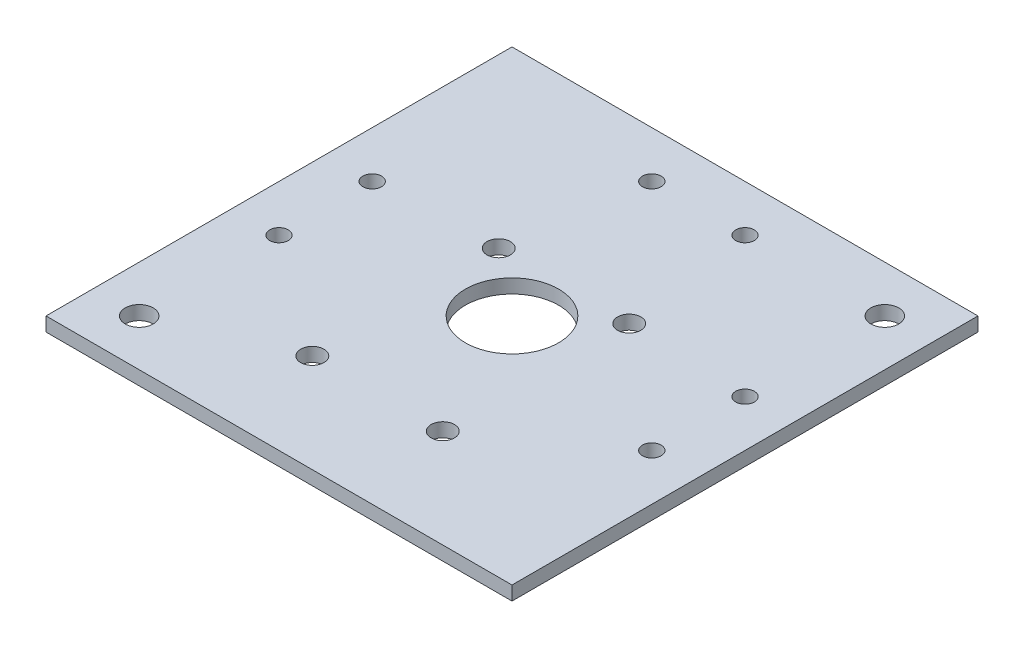
ISO-10303-21;
HEADER;
FILE_DESCRIPTION(('STEP AP214'),'2;1');
FILE_NAME('part.step','',(''),(''),'','','');
FILE_SCHEMA(('AUTOMOTIVE_DESIGN { 1 0 10303 214 1 1 1 1 }'));
ENDSEC;
DATA;
#1=APPLICATION_CONTEXT('core data for automotive mechanical design processes');
#2=APPLICATION_PROTOCOL_DEFINITION('international standard','automotive_design',2000,#1);
#3=PRODUCT_CONTEXT('',#1,'mechanical');
#4=PRODUCT('Part','Part','',(#3));
#5=PRODUCT_RELATED_PRODUCT_CATEGORY('part','',(#4));
#6=PRODUCT_DEFINITION_FORMATION('','',#4);
#7=PRODUCT_DEFINITION_CONTEXT('part definition',#1,'design');
#8=PRODUCT_DEFINITION('design','',#6,#7);
#9=PRODUCT_DEFINITION_SHAPE('','',#8);
#10=(LENGTH_UNIT() NAMED_UNIT(*) SI_UNIT(.MILLI.,.METRE.));
#11=(NAMED_UNIT(*) PLANE_ANGLE_UNIT() SI_UNIT($,.RADIAN.));
#12=(NAMED_UNIT(*) SI_UNIT($,.STERADIAN.) SOLID_ANGLE_UNIT());
#13=UNCERTAINTY_MEASURE_WITH_UNIT(LENGTH_MEASURE(1.E-05),#10,'distance_accuracy_value','');
#14=(GEOMETRIC_REPRESENTATION_CONTEXT(3) GLOBAL_UNCERTAINTY_ASSIGNED_CONTEXT((#13)) GLOBAL_UNIT_ASSIGNED_CONTEXT((#10,
#11,#12)) REPRESENTATION_CONTEXT('',''));
#15=CARTESIAN_POINT('',(0.,0.,0.));
#16=DIRECTION('',(0.,0.,1.));
#17=DIRECTION('',(1.,0.,0.));
#18=AXIS2_PLACEMENT_3D('',#15,#16,#17);
#19=CARTESIAN_POINT('',(-30.,58.,-55.001));
#20=DIRECTION('',(0.,1.,0.));
#21=DIRECTION('',(-1.,0.,0.));
#22=AXIS2_PLACEMENT_3D('',#19,#20,#21);
#23=PLANE('',#22);
#24=CARTESIAN_POINT('',(0.,58.,0.));
#25=DIRECTION('',(0.,1.,0.));
#26=DIRECTION('',(-1.,0.,0.));
#27=AXIS2_PLACEMENT_3D('',#24,#25,#26);
#28=CIRCLE('',#27,10.);
#29=CARTESIAN_POINT('',(-10.,58.,0.));
#30=VERTEX_POINT('',#29);
#31=EDGE_CURVE('E188',#30,#30,#28,.F.);
#32=ORIENTED_EDGE('',*,*,#31,.F.);
#33=EDGE_LOOP('',(#32));
#34=FACE_BOUND('',#33,.T.);
#35=CARTESIAN_POINT('',(-40.,58.,40.));
#36=DIRECTION('',(0.,1.,0.));
#37=DIRECTION('',(-1.,0.,0.));
#38=AXIS2_PLACEMENT_3D('',#35,#36,#37);
#39=CIRCLE('',#38,3.);
#40=CARTESIAN_POINT('',(-43.,58.,40.));
#41=VERTEX_POINT('',#40);
#42=EDGE_CURVE('E179',#41,#41,#39,.T.);
#43=ORIENTED_EDGE('',*,*,#42,.T.);
#44=EDGE_LOOP('',(#43));
#45=FACE_BOUND('',#44,.T.);
#46=CARTESIAN_POINT('',(40.,58.,-40.));
#47=DIRECTION('',(0.,1.,0.));
#48=DIRECTION('',(-1.,0.,0.));
#49=AXIS2_PLACEMENT_3D('',#46,#47,#48);
#50=CIRCLE('',#49,3.);
#51=CARTESIAN_POINT('',(37.,58.,-40.));
#52=VERTEX_POINT('',#51);
#53=EDGE_CURVE('E182',#52,#52,#50,.T.);
#54=ORIENTED_EDGE('',*,*,#53,.T.);
#55=EDGE_LOOP('',(#54));
#56=FACE_BOUND('',#55,.T.);
#57=CARTESIAN_POINT('',(-14.,58.,-11.15));
#58=DIRECTION('',(0.,1.,0.));
#59=DIRECTION('',(-1.,0.,0.));
#60=AXIS2_PLACEMENT_3D('',#57,#58,#59);
#61=CIRCLE('',#60,2.5);
#62=CARTESIAN_POINT('',(-16.5,58.,-11.15));
#63=VERTEX_POINT('',#62);
#64=EDGE_CURVE('E175',#63,#63,#61,.F.);
#65=ORIENTED_EDGE('',*,*,#64,.F.);
#66=EDGE_LOOP('',(#65));
#67=FACE_BOUND('',#66,.T.);
#68=CARTESIAN_POINT('',(-14.,58.,28.85));
#69=DIRECTION('',(0.,1.,0.));
#70=DIRECTION('',(-1.,0.,0.));
#71=AXIS2_PLACEMENT_3D('',#68,#69,#70);
#72=CIRCLE('',#71,2.5);
#73=CARTESIAN_POINT('',(-16.5,58.,28.85));
#74=VERTEX_POINT('',#73);
#75=EDGE_CURVE('E158',#74,#74,#72,.F.);
#76=ORIENTED_EDGE('',*,*,#75,.F.);
#77=EDGE_LOOP('',(#76));
#78=FACE_BOUND('',#77,.T.);
#79=CARTESIAN_POINT('',(14.,58.,28.85));
#80=DIRECTION('',(0.,1.,0.));
#81=DIRECTION('',(-1.,0.,0.));
#82=AXIS2_PLACEMENT_3D('',#79,#80,#81);
#83=CIRCLE('',#82,2.5);
#84=CARTESIAN_POINT('',(11.5,58.,28.85));
#85=VERTEX_POINT('',#84);
#86=EDGE_CURVE('E159',#85,#85,#83,.F.);
#87=ORIENTED_EDGE('',*,*,#86,.F.);
#88=EDGE_LOOP('',(#87));
#89=FACE_BOUND('',#88,.T.);
#90=CARTESIAN_POINT('',(14.,58.,-11.15));
#91=DIRECTION('',(0.,1.,0.));
#92=DIRECTION('',(-1.,0.,0.));
#93=AXIS2_PLACEMENT_3D('',#90,#91,#92);
#94=CIRCLE('',#93,2.5);
#95=CARTESIAN_POINT('',(11.5,58.,-11.15));
#96=VERTEX_POINT('',#95);
#97=EDGE_CURVE('E166',#96,#96,#94,.F.);
#98=ORIENTED_EDGE('',*,*,#97,.F.);
#99=EDGE_LOOP('',(#98));
#100=FACE_BOUND('',#99,.T.);
#101=CARTESIAN_POINT('',(40.,58.,-10.));
#102=DIRECTION('',(0.,1.,0.));
#103=DIRECTION('',(-1.,0.,0.));
#104=AXIS2_PLACEMENT_3D('',#101,#102,#103);
#105=CIRCLE('',#104,2.);
#106=CARTESIAN_POINT('',(38.,58.,-10.));
#107=VERTEX_POINT('',#106);
#108=EDGE_CURVE('E151',#107,#107,#105,.F.);
#109=ORIENTED_EDGE('',*,*,#108,.F.);
#110=EDGE_LOOP('',(#109));
#111=FACE_BOUND('',#110,.T.);
#112=CARTESIAN_POINT('',(-10.,58.,-40.));
#113=DIRECTION('',(0.,1.,0.));
#114=DIRECTION('',(-1.,0.,0.));
#115=AXIS2_PLACEMENT_3D('',#112,#113,#114);
#116=CIRCLE('',#115,2.);
#117=CARTESIAN_POINT('',(-12.,58.,-40.));
#118=VERTEX_POINT('',#117);
#119=EDGE_CURVE('E121',#118,#118,#116,.F.);
#120=ORIENTED_EDGE('',*,*,#119,.F.);
#121=EDGE_LOOP('',(#120));
#122=FACE_BOUND('',#121,.T.);
#123=CARTESIAN_POINT('',(9.99999999999999,58.,-40.));
#124=DIRECTION('',(0.,1.,0.));
#125=DIRECTION('',(-1.,0.,0.));
#126=AXIS2_PLACEMENT_3D('',#123,#124,#125);
#127=CIRCLE('',#126,2.);
#128=CARTESIAN_POINT('',(7.99999999999999,58.,-40.));
#129=VERTEX_POINT('',#128);
#130=EDGE_CURVE('E142',#129,#129,#127,.F.);
#131=ORIENTED_EDGE('',*,*,#130,.F.);
#132=EDGE_LOOP('',(#131));
#133=FACE_BOUND('',#132,.T.);
#134=CARTESIAN_POINT('',(-40.,58.,-10.));
#135=DIRECTION('',(0.,1.,0.));
#136=DIRECTION('',(-1.,0.,0.));
#137=AXIS2_PLACEMENT_3D('',#134,#135,#136);
#138=CIRCLE('',#137,2.);
#139=CARTESIAN_POINT('',(-42.,58.,-10.));
#140=VERTEX_POINT('',#139);
#141=EDGE_CURVE('E136',#140,#140,#138,.F.);
#142=ORIENTED_EDGE('',*,*,#141,.F.);
#143=EDGE_LOOP('',(#142));
#144=FACE_BOUND('',#143,.T.);
#145=CARTESIAN_POINT('',(-40.,58.,9.99999999999997));
#146=DIRECTION('',(0.,1.,0.));
#147=DIRECTION('',(-1.,0.,0.));
#148=AXIS2_PLACEMENT_3D('',#145,#146,#147);
#149=CIRCLE('',#148,2.);
#150=CARTESIAN_POINT('',(-42.,58.,9.99999999999997));
#151=VERTEX_POINT('',#150);
#152=EDGE_CURVE('E129',#151,#151,#149,.F.);
#153=ORIENTED_EDGE('',*,*,#152,.F.);
#154=EDGE_LOOP('',(#153));
#155=FACE_BOUND('',#154,.T.);
#156=CARTESIAN_POINT('',(40.,58.,9.99999999999998));
#157=DIRECTION('',(0.,1.,0.));
#158=DIRECTION('',(-1.,0.,0.));
#159=AXIS2_PLACEMENT_3D('',#156,#157,#158);
#160=CIRCLE('',#159,2.);
#161=CARTESIAN_POINT('',(38.,58.,9.99999999999998));
#162=VERTEX_POINT('',#161);
#163=EDGE_CURVE('E128',#162,#162,#160,.F.);
#164=ORIENTED_EDGE('',*,*,#163,.F.);
#165=EDGE_LOOP('',(#164));
#166=FACE_BOUND('',#165,.T.);
#167=DIRECTION('',(1.,0.,0.));
#168=VECTOR('',#167,1.);
#169=CARTESIAN_POINT('',(50.,58.,-50.));
#170=LINE('',#169,#168);
#171=CARTESIAN_POINT('',(-50.,58.,-50.));
#172=VERTEX_POINT('',#171);
#173=CARTESIAN_POINT('',(50.,58.,-50.));
#174=VERTEX_POINT('',#173);
#175=EDGE_CURVE('E109',#172,#174,#170,.T.);
#176=ORIENTED_EDGE('',*,*,#175,.T.);
#177=DIRECTION('',(0.,0.,1.));
#178=VECTOR('',#177,1.);
#179=CARTESIAN_POINT('',(50.,58.,50.));
#180=LINE('',#179,#178);
#181=CARTESIAN_POINT('',(50.,58.,50.));
#182=VERTEX_POINT('',#181);
#183=EDGE_CURVE('E104',#174,#182,#180,.T.);
#184=ORIENTED_EDGE('',*,*,#183,.T.);
#185=DIRECTION('',(-1.,0.,0.));
#186=VECTOR('',#185,1.);
#187=CARTESIAN_POINT('',(50.,58.,50.));
#188=LINE('',#187,#186);
#189=CARTESIAN_POINT('',(-50.,58.,50.));
#190=VERTEX_POINT('',#189);
#191=EDGE_CURVE('E93',#182,#190,#188,.T.);
#192=ORIENTED_EDGE('',*,*,#191,.T.);
#193=DIRECTION('',(0.,0.,-1.));
#194=VECTOR('',#193,1.);
#195=CARTESIAN_POINT('',(-50.,58.,50.));
#196=LINE('',#195,#194);
#197=EDGE_CURVE('E111',#190,#172,#196,.T.);
#198=ORIENTED_EDGE('',*,*,#197,.T.);
#199=EDGE_LOOP('',(#176,#184,#192,#198));
#200=FACE_BOUND('',#199,.T.);
#201=ADVANCED_FACE('F52',(#34,#45,#56,#67,#78,#89,#100,#111,#122,#133,#144,#155,#166,#200),#23,.F.);
#202=CARTESIAN_POINT('',(0.,61.,0.));
#203=DIRECTION('',(0.,-1.,0.));
#204=DIRECTION('',(1.,0.,0.));
#205=AXIS2_PLACEMENT_3D('',#202,#203,#204);
#206=PLANE('',#205);
#207=CARTESIAN_POINT('',(0.,61.,0.));
#208=DIRECTION('',(0.,1.,0.));
#209=DIRECTION('',(-1.,0.,0.));
#210=AXIS2_PLACEMENT_3D('',#207,#208,#209);
#211=CIRCLE('',#210,10.);
#212=CARTESIAN_POINT('',(-10.,61.,0.));
#213=VERTEX_POINT('',#212);
#214=EDGE_CURVE('E185',#213,#213,#211,.T.);
#215=ORIENTED_EDGE('',*,*,#214,.F.);
#216=EDGE_LOOP('',(#215));
#217=FACE_BOUND('',#216,.T.);
#218=CARTESIAN_POINT('',(40.,61.,9.99999999999998));
#219=DIRECTION('',(0.,1.,0.));
#220=DIRECTION('',(1.,0.,0.));
#221=AXIS2_PLACEMENT_3D('',#218,#219,#220);
#222=CIRCLE('',#221,2.);
#223=CARTESIAN_POINT('',(42.,61.,9.99999999999998));
#224=VERTEX_POINT('',#223);
#225=EDGE_CURVE('E125',#224,#224,#222,.T.);
#226=ORIENTED_EDGE('',*,*,#225,.F.);
#227=EDGE_LOOP('',(#226));
#228=FACE_BOUND('',#227,.T.);
#229=CARTESIAN_POINT('',(-40.,61.,9.99999999999997));
#230=DIRECTION('',(0.,1.,0.));
#231=DIRECTION('',(-1.,0.,0.));
#232=AXIS2_PLACEMENT_3D('',#229,#230,#231);
#233=CIRCLE('',#232,2.);
#234=CARTESIAN_POINT('',(-42.,61.,9.99999999999997));
#235=VERTEX_POINT('',#234);
#236=EDGE_CURVE('E133',#235,#235,#233,.T.);
#237=ORIENTED_EDGE('',*,*,#236,.F.);
#238=EDGE_LOOP('',(#237));
#239=FACE_BOUND('',#238,.T.);
#240=CARTESIAN_POINT('',(-40.,61.,-10.));
#241=DIRECTION('',(0.,1.,0.));
#242=DIRECTION('',(1.,0.,0.));
#243=AXIS2_PLACEMENT_3D('',#240,#241,#242);
#244=CIRCLE('',#243,2.);
#245=CARTESIAN_POINT('',(-38.,61.,-10.));
#246=VERTEX_POINT('',#245);
#247=EDGE_CURVE('E139',#246,#246,#244,.T.);
#248=ORIENTED_EDGE('',*,*,#247,.F.);
#249=EDGE_LOOP('',(#248));
#250=FACE_BOUND('',#249,.T.);
#251=CARTESIAN_POINT('',(9.99999999999999,61.,-40.));
#252=DIRECTION('',(0.,1.,0.));
#253=DIRECTION('',(-1.,0.,0.));
#254=AXIS2_PLACEMENT_3D('',#251,#252,#253);
#255=CIRCLE('',#254,2.);
#256=CARTESIAN_POINT('',(7.99999999999999,61.,-40.));
#257=VERTEX_POINT('',#256);
#258=EDGE_CURVE('E124',#257,#257,#255,.T.);
#259=ORIENTED_EDGE('',*,*,#258,.F.);
#260=EDGE_LOOP('',(#259));
#261=FACE_BOUND('',#260,.T.);
#262=CARTESIAN_POINT('',(-10.,61.,-40.));
#263=DIRECTION('',(0.,1.,0.));
#264=DIRECTION('',(1.,0.,0.));
#265=AXIS2_PLACEMENT_3D('',#262,#263,#264);
#266=CIRCLE('',#265,2.);
#267=CARTESIAN_POINT('',(-8.,61.,-40.));
#268=VERTEX_POINT('',#267);
#269=EDGE_CURVE('E100',#268,#268,#266,.T.);
#270=ORIENTED_EDGE('',*,*,#269,.F.);
#271=EDGE_LOOP('',(#270));
#272=FACE_BOUND('',#271,.T.);
#273=CARTESIAN_POINT('',(40.,61.,-10.));
#274=DIRECTION('',(0.,1.,0.));
#275=DIRECTION('',(-1.,0.,0.));
#276=AXIS2_PLACEMENT_3D('',#273,#274,#275);
#277=CIRCLE('',#276,2.);
#278=CARTESIAN_POINT('',(38.,61.,-10.));
#279=VERTEX_POINT('',#278);
#280=EDGE_CURVE('E132',#279,#279,#277,.T.);
#281=ORIENTED_EDGE('',*,*,#280,.F.);
#282=EDGE_LOOP('',(#281));
#283=FACE_BOUND('',#282,.T.);
#284=CARTESIAN_POINT('',(14.,61.,-11.15));
#285=DIRECTION('',(0.,1.,0.));
#286=DIRECTION('',(1.,0.,0.));
#287=AXIS2_PLACEMENT_3D('',#284,#285,#286);
#288=CIRCLE('',#287,2.5);
#289=CARTESIAN_POINT('',(16.5,61.,-11.15));
#290=VERTEX_POINT('',#289);
#291=EDGE_CURVE('E154',#290,#290,#288,.T.);
#292=ORIENTED_EDGE('',*,*,#291,.F.);
#293=EDGE_LOOP('',(#292));
#294=FACE_BOUND('',#293,.T.);
#295=CARTESIAN_POINT('',(14.,61.,28.85));
#296=DIRECTION('',(0.,1.,0.));
#297=DIRECTION('',(1.,0.,0.));
#298=AXIS2_PLACEMENT_3D('',#295,#296,#297);
#299=CIRCLE('',#298,2.5);
#300=CARTESIAN_POINT('',(16.5,61.,28.85));
#301=VERTEX_POINT('',#300);
#302=EDGE_CURVE('E163',#301,#301,#299,.T.);
#303=ORIENTED_EDGE('',*,*,#302,.F.);
#304=EDGE_LOOP('',(#303));
#305=FACE_BOUND('',#304,.T.);
#306=CARTESIAN_POINT('',(-14.,61.,28.85));
#307=DIRECTION('',(0.,1.,0.));
#308=DIRECTION('',(-1.,0.,0.));
#309=AXIS2_PLACEMENT_3D('',#306,#307,#308);
#310=CIRCLE('',#309,2.5);
#311=CARTESIAN_POINT('',(-16.5,61.,28.85));
#312=VERTEX_POINT('',#311);
#313=EDGE_CURVE('E155',#312,#312,#310,.T.);
#314=ORIENTED_EDGE('',*,*,#313,.F.);
#315=EDGE_LOOP('',(#314));
#316=FACE_BOUND('',#315,.T.);
#317=CARTESIAN_POINT('',(-14.,61.,-11.15));
#318=DIRECTION('',(0.,1.,0.));
#319=DIRECTION('',(-1.,0.,0.));
#320=AXIS2_PLACEMENT_3D('',#317,#318,#319);
#321=CIRCLE('',#320,2.5);
#322=CARTESIAN_POINT('',(-16.5,61.,-11.15));
#323=VERTEX_POINT('',#322);
#324=EDGE_CURVE('E162',#323,#323,#321,.T.);
#325=ORIENTED_EDGE('',*,*,#324,.F.);
#326=EDGE_LOOP('',(#325));
#327=FACE_BOUND('',#326,.T.);
#328=CARTESIAN_POINT('',(40.,61.,-40.));
#329=DIRECTION('',(0.,-1.,0.));
#330=DIRECTION('',(1.,0.,0.));
#331=AXIS2_PLACEMENT_3D('',#328,#329,#330);
#332=CIRCLE('',#331,3.);
#333=CARTESIAN_POINT('',(43.,61.,-40.));
#334=VERTEX_POINT('',#333);
#335=EDGE_CURVE('E55',#334,#334,#332,.T.);
#336=ORIENTED_EDGE('',*,*,#335,.T.);
#337=EDGE_LOOP('',(#336));
#338=FACE_BOUND('',#337,.T.);
#339=CARTESIAN_POINT('',(-40.,61.,40.));
#340=DIRECTION('',(0.,-1.,0.));
#341=DIRECTION('',(1.,0.,0.));
#342=AXIS2_PLACEMENT_3D('',#339,#340,#341);
#343=CIRCLE('',#342,3.);
#344=CARTESIAN_POINT('',(-37.,61.,40.));
#345=VERTEX_POINT('',#344);
#346=EDGE_CURVE('E178',#345,#345,#343,.T.);
#347=ORIENTED_EDGE('',*,*,#346,.T.);
#348=EDGE_LOOP('',(#347));
#349=FACE_BOUND('',#348,.T.);
#350=DIRECTION('',(1.,0.,0.));
#351=VECTOR('',#350,1.);
#352=CARTESIAN_POINT('',(50.,61.,-50.));
#353=LINE('',#352,#351);
#354=CARTESIAN_POINT('',(-50.,61.,-50.));
#355=VERTEX_POINT('',#354);
#356=CARTESIAN_POINT('',(50.,61.,-50.));
#357=VERTEX_POINT('',#356);
#358=EDGE_CURVE('E191',#355,#357,#353,.T.);
#359=ORIENTED_EDGE('',*,*,#358,.F.);
#360=DIRECTION('',(0.,0.,-1.));
#361=VECTOR('',#360,1.);
#362=CARTESIAN_POINT('',(-50.,61.,50.));
#363=LINE('',#362,#361);
#364=CARTESIAN_POINT('',(-50.,61.,50.));
#365=VERTEX_POINT('',#364);
#366=EDGE_CURVE('E13',#365,#355,#363,.T.);
#367=ORIENTED_EDGE('',*,*,#366,.F.);
#368=DIRECTION('',(-1.,0.,0.));
#369=VECTOR('',#368,1.);
#370=CARTESIAN_POINT('',(50.,61.,50.));
#371=LINE('',#370,#369);
#372=CARTESIAN_POINT('',(50.,61.,50.));
#373=VERTEX_POINT('',#372);
#374=EDGE_CURVE('E60',#373,#365,#371,.T.);
#375=ORIENTED_EDGE('',*,*,#374,.F.);
#376=DIRECTION('',(0.,0.,1.));
#377=VECTOR('',#376,1.);
#378=CARTESIAN_POINT('',(50.,61.,50.));
#379=LINE('',#378,#377);
#380=EDGE_CURVE('E76',#357,#373,#379,.T.);
#381=ORIENTED_EDGE('',*,*,#380,.F.);
#382=EDGE_LOOP('',(#359,#367,#375,#381));
#383=FACE_BOUND('',#382,.T.);
#384=ADVANCED_FACE('F197',(#217,#228,#239,#250,#261,#272,#283,#294,#305,#316,#327,#338,#349,
#383),#206,.F.);
#385=CARTESIAN_POINT('',(0.,-0.00100000000000794,0.));
#386=DIRECTION('',(0.,1.,0.));
#387=DIRECTION('',(-1.,0.,0.));
#388=AXIS2_PLACEMENT_3D('',#385,#386,#387);
#389=CYLINDRICAL_SURFACE('',#388,10.);
#390=ORIENTED_EDGE('',*,*,#214,.T.);
#391=EDGE_LOOP('',(#390));
#392=FACE_BOUND('',#391,.T.);
#393=ORIENTED_EDGE('',*,*,#31,.T.);
#394=EDGE_LOOP('',(#393));
#395=FACE_BOUND('',#394,.T.);
#396=ADVANCED_FACE('F204',(#392,#395),#389,.F.);
#397=CARTESIAN_POINT('',(-40.,24.,40.));
#398=DIRECTION('',(0.,1.,0.));
#399=DIRECTION('',(0.,0.,1.));
#400=AXIS2_PLACEMENT_3D('',#397,#398,#399);
#401=CYLINDRICAL_SURFACE('',#400,3.);
#402=ORIENTED_EDGE('',*,*,#346,.F.);
#403=EDGE_LOOP('',(#402));
#404=FACE_BOUND('',#403,.T.);
#405=ORIENTED_EDGE('',*,*,#42,.F.);
#406=EDGE_LOOP('',(#405));
#407=FACE_BOUND('',#406,.T.);
#408=ADVANCED_FACE('F200',(#404,#407),#401,.F.);
#409=CARTESIAN_POINT('',(40.,24.,-40.));
#410=DIRECTION('',(0.,1.,0.));
#411=DIRECTION('',(0.,0.,1.));
#412=AXIS2_PLACEMENT_3D('',#409,#410,#411);
#413=CYLINDRICAL_SURFACE('',#412,3.);
#414=ORIENTED_EDGE('',*,*,#335,.F.);
#415=EDGE_LOOP('',(#414));
#416=FACE_BOUND('',#415,.T.);
#417=ORIENTED_EDGE('',*,*,#53,.F.);
#418=EDGE_LOOP('',(#417));
#419=FACE_BOUND('',#418,.T.);
#420=ADVANCED_FACE('F203',(#416,#419),#413,.F.);
#421=CARTESIAN_POINT('',(-14.,-0.00100000000000794,-11.15));
#422=DIRECTION('',(0.,1.,0.));
#423=DIRECTION('',(-1.,0.,0.));
#424=AXIS2_PLACEMENT_3D('',#421,#422,#423);
#425=CYLINDRICAL_SURFACE('',#424,2.5);
#426=ORIENTED_EDGE('',*,*,#324,.T.);
#427=EDGE_LOOP('',(#426));
#428=FACE_BOUND('',#427,.T.);
#429=ORIENTED_EDGE('',*,*,#64,.T.);
#430=EDGE_LOOP('',(#429));
#431=FACE_BOUND('',#430,.T.);
#432=ADVANCED_FACE('F267',(#428,#431),#425,.F.);
#433=CARTESIAN_POINT('',(-14.,-0.00100000000000794,28.85));
#434=DIRECTION('',(0.,1.,0.));
#435=DIRECTION('',(-1.,0.,0.));
#436=AXIS2_PLACEMENT_3D('',#433,#434,#435);
#437=CYLINDRICAL_SURFACE('',#436,2.5);
#438=ORIENTED_EDGE('',*,*,#313,.T.);
#439=EDGE_LOOP('',(#438));
#440=FACE_BOUND('',#439,.T.);
#441=ORIENTED_EDGE('',*,*,#75,.T.);
#442=EDGE_LOOP('',(#441));
#443=FACE_BOUND('',#442,.T.);
#444=ADVANCED_FACE('F263',(#440,#443),#437,.F.);
#445=CARTESIAN_POINT('',(14.,-0.00100000000000794,28.85));
#446=DIRECTION('',(0.,1.,0.));
#447=DIRECTION('',(-1.,0.,0.));
#448=AXIS2_PLACEMENT_3D('',#445,#446,#447);
#449=CYLINDRICAL_SURFACE('',#448,2.5);
#450=ORIENTED_EDGE('',*,*,#302,.T.);
#451=EDGE_LOOP('',(#450));
#452=FACE_BOUND('',#451,.T.);
#453=ORIENTED_EDGE('',*,*,#86,.T.);
#454=EDGE_LOOP('',(#453));
#455=FACE_BOUND('',#454,.T.);
#456=ADVANCED_FACE('F266',(#452,#455),#449,.F.);
#457=CARTESIAN_POINT('',(14.,-0.00100000000000794,-11.15));
#458=DIRECTION('',(0.,1.,0.));
#459=DIRECTION('',(-1.,0.,0.));
#460=AXIS2_PLACEMENT_3D('',#457,#458,#459);
#461=CYLINDRICAL_SURFACE('',#460,2.5);
#462=ORIENTED_EDGE('',*,*,#291,.T.);
#463=EDGE_LOOP('',(#462));
#464=FACE_BOUND('',#463,.T.);
#465=ORIENTED_EDGE('',*,*,#97,.T.);
#466=EDGE_LOOP('',(#465));
#467=FACE_BOUND('',#466,.T.);
#468=ADVANCED_FACE('F261',(#464,#467),#461,.F.);
#469=CARTESIAN_POINT('',(40.,-0.001000000000001,-10.));
#470=DIRECTION('',(0.,1.,0.));
#471=DIRECTION('',(-1.,0.,0.));
#472=AXIS2_PLACEMENT_3D('',#469,#470,#471);
#473=CYLINDRICAL_SURFACE('',#472,2.);
#474=ORIENTED_EDGE('',*,*,#280,.T.);
#475=EDGE_LOOP('',(#474));
#476=FACE_BOUND('',#475,.T.);
#477=ORIENTED_EDGE('',*,*,#108,.T.);
#478=EDGE_LOOP('',(#477));
#479=FACE_BOUND('',#478,.T.);
#480=ADVANCED_FACE('F258',(#476,#479),#473,.F.);
#481=CARTESIAN_POINT('',(-9.99999999999999,-0.00100000000000794,-40.));
#482=DIRECTION('',(0.,1.,0.));
#483=DIRECTION('',(-1.,0.,0.));
#484=AXIS2_PLACEMENT_3D('',#481,#482,#483);
#485=CYLINDRICAL_SURFACE('',#484,2.);
#486=ORIENTED_EDGE('',*,*,#269,.T.);
#487=EDGE_LOOP('',(#486));
#488=FACE_BOUND('',#487,.T.);
#489=ORIENTED_EDGE('',*,*,#119,.T.);
#490=EDGE_LOOP('',(#489));
#491=FACE_BOUND('',#490,.T.);
#492=ADVANCED_FACE('F249',(#488,#491),#485,.F.);
#493=CARTESIAN_POINT('',(10.,-0.00100000000000794,-40.));
#494=DIRECTION('',(0.,1.,0.));
#495=DIRECTION('',(-1.,0.,0.));
#496=AXIS2_PLACEMENT_3D('',#493,#494,#495);
#497=CYLINDRICAL_SURFACE('',#496,2.);
#498=ORIENTED_EDGE('',*,*,#258,.T.);
#499=EDGE_LOOP('',(#498));
#500=FACE_BOUND('',#499,.T.);
#501=ORIENTED_EDGE('',*,*,#130,.T.);
#502=EDGE_LOOP('',(#501));
#503=FACE_BOUND('',#502,.T.);
#504=ADVANCED_FACE('F253',(#500,#503),#497,.F.);
#505=CARTESIAN_POINT('',(-40.,-0.00100000000001488,-10.));
#506=DIRECTION('',(0.,1.,0.));
#507=DIRECTION('',(-1.,0.,0.));
#508=AXIS2_PLACEMENT_3D('',#505,#506,#507);
#509=CYLINDRICAL_SURFACE('',#508,2.);
#510=ORIENTED_EDGE('',*,*,#247,.T.);
#511=EDGE_LOOP('',(#510));
#512=FACE_BOUND('',#511,.T.);
#513=ORIENTED_EDGE('',*,*,#141,.T.);
#514=EDGE_LOOP('',(#513));
#515=FACE_BOUND('',#514,.T.);
#516=ADVANCED_FACE('F245',(#512,#515),#509,.F.);
#517=CARTESIAN_POINT('',(-40.,-0.00100000000001488,9.99999999999997));
#518=DIRECTION('',(0.,1.,0.));
#519=DIRECTION('',(-1.,0.,0.));
#520=AXIS2_PLACEMENT_3D('',#517,#518,#519);
#521=CYLINDRICAL_SURFACE('',#520,2.);
#522=ORIENTED_EDGE('',*,*,#236,.T.);
#523=EDGE_LOOP('',(#522));
#524=FACE_BOUND('',#523,.T.);
#525=ORIENTED_EDGE('',*,*,#152,.T.);
#526=EDGE_LOOP('',(#525));
#527=FACE_BOUND('',#526,.T.);
#528=ADVANCED_FACE('F236',(#524,#527),#521,.F.);
#529=CARTESIAN_POINT('',(40.,-0.001000000000001,9.99999999999998));
#530=DIRECTION('',(0.,1.,0.));
#531=DIRECTION('',(-1.,0.,0.));
#532=AXIS2_PLACEMENT_3D('',#529,#530,#531);
#533=CYLINDRICAL_SURFACE('',#532,2.);
#534=ORIENTED_EDGE('',*,*,#225,.T.);
#535=EDGE_LOOP('',(#534));
#536=FACE_BOUND('',#535,.T.);
#537=ORIENTED_EDGE('',*,*,#163,.T.);
#538=EDGE_LOOP('',(#537));
#539=FACE_BOUND('',#538,.T.);
#540=ADVANCED_FACE('F233',(#536,#539),#533,.F.);
#541=CARTESIAN_POINT('',(-50.,57.999,50.));
#542=DIRECTION('',(-1.,0.,0.));
#543=DIRECTION('',(0.,-1.,0.));
#544=AXIS2_PLACEMENT_3D('',#541,#542,#543);
#545=PLANE('',#544);
#546=ORIENTED_EDGE('',*,*,#366,.T.);
#547=DIRECTION('',(0.,1.,0.));
#548=VECTOR('',#547,1.);
#549=CARTESIAN_POINT('',(-50.,57.999,-50.));
#550=LINE('',#549,#548);
#551=EDGE_CURVE('E101',#172,#355,#550,.T.);
#552=ORIENTED_EDGE('',*,*,#551,.F.);
#553=ORIENTED_EDGE('',*,*,#197,.F.);
#554=DIRECTION('',(0.,1.,0.));
#555=VECTOR('',#554,1.);
#556=CARTESIAN_POINT('',(-50.,57.999,50.));
#557=LINE('',#556,#555);
#558=EDGE_CURVE('E68',#190,#365,#557,.T.);
#559=ORIENTED_EDGE('',*,*,#558,.T.);
#560=EDGE_LOOP('',(#546,#552,#553,#559));
#561=FACE_BOUND('',#560,.T.);
#562=ADVANCED_FACE('F235',(#561),#545,.T.);
#563=CARTESIAN_POINT('',(50.,57.999,50.));
#564=DIRECTION('',(1.,0.,0.));
#565=DIRECTION('',(0.,1.,0.));
#566=AXIS2_PLACEMENT_3D('',#563,#564,#565);
#567=PLANE('',#566);
#568=ORIENTED_EDGE('',*,*,#380,.T.);
#569=DIRECTION('',(0.,1.,0.));
#570=VECTOR('',#569,1.);
#571=CARTESIAN_POINT('',(50.,57.999,50.));
#572=LINE('',#571,#570);
#573=EDGE_CURVE('E95',#182,#373,#572,.T.);
#574=ORIENTED_EDGE('',*,*,#573,.F.);
#575=ORIENTED_EDGE('',*,*,#183,.F.);
#576=DIRECTION('',(0.,1.,0.));
#577=VECTOR('',#576,1.);
#578=CARTESIAN_POINT('',(50.,57.999,-50.));
#579=LINE('',#578,#577);
#580=EDGE_CURVE('E106',#174,#357,#579,.T.);
#581=ORIENTED_EDGE('',*,*,#580,.T.);
#582=EDGE_LOOP('',(#568,#574,#575,#581));
#583=FACE_BOUND('',#582,.T.);
#584=ADVANCED_FACE('F103',(#583),#567,.T.);
#585=CARTESIAN_POINT('',(50.,57.999,-50.));
#586=DIRECTION('',(0.,0.,-1.));
#587=DIRECTION('',(-1.,0.,0.));
#588=AXIS2_PLACEMENT_3D('',#585,#586,#587);
#589=PLANE('',#588);
#590=ORIENTED_EDGE('',*,*,#358,.T.);
#591=ORIENTED_EDGE('',*,*,#580,.F.);
#592=ORIENTED_EDGE('',*,*,#175,.F.);
#593=ORIENTED_EDGE('',*,*,#551,.T.);
#594=EDGE_LOOP('',(#590,#591,#592,#593));
#595=FACE_BOUND('',#594,.T.);
#596=ADVANCED_FACE('F363',(#595),#589,.T.);
#597=CARTESIAN_POINT('',(50.,57.999,50.));
#598=DIRECTION('',(0.,0.,1.));
#599=DIRECTION('',(1.,0.,0.));
#600=AXIS2_PLACEMENT_3D('',#597,#598,#599);
#601=PLANE('',#600);
#602=ORIENTED_EDGE('',*,*,#374,.T.);
#603=ORIENTED_EDGE('',*,*,#558,.F.);
#604=ORIENTED_EDGE('',*,*,#191,.F.);
#605=ORIENTED_EDGE('',*,*,#573,.T.);
#606=EDGE_LOOP('',(#602,#603,#604,#605));
#607=FACE_BOUND('',#606,.T.);
#608=ADVANCED_FACE('F94',(#607),#601,.T.);
#609=CLOSED_SHELL('',(#201,#384,#396,#408,#420,#432,#444,#456,#468,#480,#492,#504,#516,#528,
#540,#562,#584,#596,#608));
#610=MANIFOLD_SOLID_BREP('B2',#609);
#611=ADVANCED_BREP_SHAPE_REPRESENTATION('',(#18,#610),#14);
#612=SHAPE_DEFINITION_REPRESENTATION(#9,#611);
ENDSEC;
END-ISO-10303-21;
